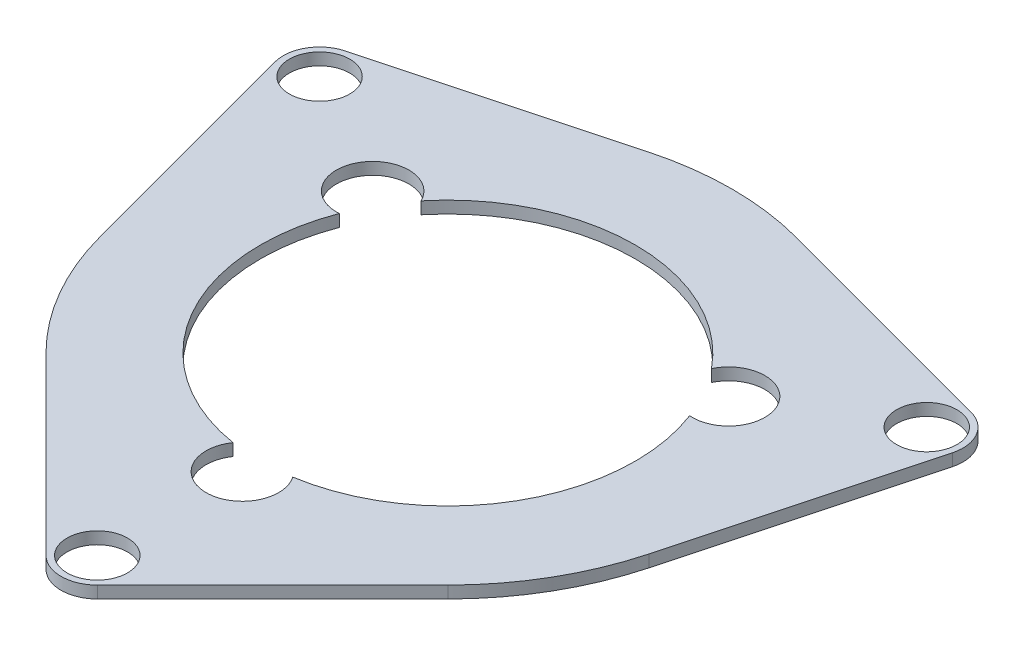
ISO-10303-21;
HEADER;
FILE_DESCRIPTION(('STEP AP214'),'2;1');
FILE_NAME('part.step','',(''),(''),'','','');
FILE_SCHEMA(('AUTOMOTIVE_DESIGN { 1 0 10303 214 1 1 1 1 }'));
ENDSEC;
DATA;
#1=APPLICATION_CONTEXT('core data for automotive mechanical design processes');
#2=APPLICATION_PROTOCOL_DEFINITION('international standard','automotive_design',2000,#1);
#3=PRODUCT_CONTEXT('',#1,'mechanical');
#4=PRODUCT('Part','Part','',(#3));
#5=PRODUCT_RELATED_PRODUCT_CATEGORY('part','',(#4));
#6=PRODUCT_DEFINITION_FORMATION('','',#4);
#7=PRODUCT_DEFINITION_CONTEXT('part definition',#1,'design');
#8=PRODUCT_DEFINITION('design','',#6,#7);
#9=PRODUCT_DEFINITION_SHAPE('','',#8);
#10=(LENGTH_UNIT() NAMED_UNIT(*) SI_UNIT(.MILLI.,.METRE.));
#11=(NAMED_UNIT(*) PLANE_ANGLE_UNIT() SI_UNIT($,.RADIAN.));
#12=(NAMED_UNIT(*) SI_UNIT($,.STERADIAN.) SOLID_ANGLE_UNIT());
#13=UNCERTAINTY_MEASURE_WITH_UNIT(LENGTH_MEASURE(1.E-05),#10,'distance_accuracy_value','');
#14=(GEOMETRIC_REPRESENTATION_CONTEXT(3) GLOBAL_UNCERTAINTY_ASSIGNED_CONTEXT((#13)) GLOBAL_UNIT_ASSIGNED_CONTEXT((#10,
#11,#12)) REPRESENTATION_CONTEXT('',''));
#15=CARTESIAN_POINT('',(0.,0.,0.));
#16=DIRECTION('',(0.,0.,1.));
#17=DIRECTION('',(1.,0.,0.));
#18=AXIS2_PLACEMENT_3D('',#15,#16,#17);
#19=CARTESIAN_POINT('',(0.,0.5,0.));
#20=DIRECTION('',(0.,-1.,0.));
#21=DIRECTION('',(0.,0.,-1.));
#22=AXIS2_PLACEMENT_3D('',#19,#20,#21);
#23=PLANE('',#22);
#24=CARTESIAN_POINT('',(0.,0.5,14.4999999999999));
#25=DIRECTION('',(0.,1.,0.));
#26=DIRECTION('',(0.,0.,1.));
#27=AXIS2_PLACEMENT_3D('',#24,#25,#26);
#28=CIRCLE('',#27,1.25);
#29=CARTESIAN_POINT('',(0.,0.5,15.7499999999999));
#30=VERTEX_POINT('',#29);
#31=EDGE_CURVE('E207',#30,#30,#28,.T.);
#32=ORIENTED_EDGE('',*,*,#31,.F.);
#33=EDGE_LOOP('',(#32));
#34=FACE_BOUND('',#33,.T.);
#35=CARTESIAN_POINT('',(-12.5573683548744,0.5,-7.24999999999988));
#36=DIRECTION('',(0.,1.,0.));
#37=DIRECTION('',(0.,0.,1.));
#38=AXIS2_PLACEMENT_3D('',#35,#36,#37);
#39=CIRCLE('',#38,1.25);
#40=CARTESIAN_POINT('',(-12.5573683548744,0.5,-5.99999999999988));
#41=VERTEX_POINT('',#40);
#42=EDGE_CURVE('E219',#41,#41,#39,.T.);
#43=ORIENTED_EDGE('',*,*,#42,.F.);
#44=EDGE_LOOP('',(#43));
#45=FACE_BOUND('',#44,.T.);
#46=CARTESIAN_POINT('',(0.,0.5,0.));
#47=DIRECTION('',(0.,1.,0.));
#48=DIRECTION('',(0.,0.,-1.));
#49=AXIS2_PLACEMENT_3D('',#46,#47,#48);
#50=CIRCLE('',#49,11.753048327205);
#51=CARTESIAN_POINT('',(3.0419127450911,0.5,-11.3525729168708));
#52=VERTEX_POINT('',#51);
#53=CARTESIAN_POINT('',(-3.0419127450911,0.5,-11.3525729168708));
#54=VERTEX_POINT('',#53);
#55=EDGE_CURVE('E225',#52,#54,#50,.T.);
#56=ORIENTED_EDGE('',*,*,#55,.T.);
#57=DIRECTION('',(-0.965925826289065,0.,0.258819045102533));
#58=VECTOR('',#57,1.);
#59=CARTESIAN_POINT('',(-3.0419127450911,0.5,-11.3525729168708));
#60=LINE('',#59,#58);
#61=CARTESIAN_POINT('',(-12.9455969225282,0.5,-8.69888873943348));
#62=VERTEX_POINT('',#61);
#63=EDGE_CURVE('E228',#54,#62,#60,.T.);
#64=ORIENTED_EDGE('',*,*,#63,.T.);
#65=CARTESIAN_POINT('',(-12.5573683548744,0.5,-7.24999999999988));
#66=DIRECTION('',(0.,1.,0.));
#67=DIRECTION('',(0.,0.,-1.));
#68=AXIS2_PLACEMENT_3D('',#65,#66,#67);
#69=CIRCLE('',#68,1.5);
#70=CARTESIAN_POINT('',(-14.006257094308,0.5,-6.86177143234609));
#71=VERTEX_POINT('',#70);
#72=EDGE_CURVE('E231',#62,#71,#69,.T.);
#73=ORIENTED_EDGE('',*,*,#72,.T.);
#74=DIRECTION('',(0.258819045102528,0.,0.965925826289066));
#75=VECTOR('',#74,1.);
#76=CARTESIAN_POINT('',(-11.3525729168708,0.5,3.04191274509105));
#77=LINE('',#76,#75);
#78=CARTESIAN_POINT('',(-11.3525729168708,0.5,3.04191274509105));
#79=VERTEX_POINT('',#78);
#80=EDGE_CURVE('E233',#71,#79,#77,.T.);
#81=ORIENTED_EDGE('',*,*,#80,.T.);
#82=CARTESIAN_POINT('',(0.,0.5,0.));
#83=DIRECTION('',(0.,1.,0.));
#84=DIRECTION('',(0.,0.,1.));
#85=AXIS2_PLACEMENT_3D('',#82,#83,#84);
#86=CIRCLE('',#85,11.753048327205);
#87=CARTESIAN_POINT('',(-8.31066017177983,0.5,8.31066017177985));
#88=VERTEX_POINT('',#87);
#89=EDGE_CURVE('E235',#79,#88,#86,.T.);
#90=ORIENTED_EDGE('',*,*,#89,.T.);
#91=DIRECTION('',(0.707106781186549,0.,0.707106781186546));
#92=VECTOR('',#91,1.);
#93=CARTESIAN_POINT('',(-8.31066017177982,0.5,8.31066017177985));
#94=LINE('',#93,#92);
#95=CARTESIAN_POINT('',(-1.06066017177982,0.5,15.5606601717798));
#96=VERTEX_POINT('',#95);
#97=EDGE_CURVE('E237',#88,#96,#94,.T.);
#98=ORIENTED_EDGE('',*,*,#97,.T.);
#99=CARTESIAN_POINT('',(0.,0.5,14.4999999999999));
#100=DIRECTION('',(0.,1.,0.));
#101=DIRECTION('',(0.,0.,1.));
#102=AXIS2_PLACEMENT_3D('',#99,#100,#101);
#103=CIRCLE('',#102,1.50000000000005);
#104=CARTESIAN_POINT('',(1.06066017177982,0.5,15.5606601717798));
#105=VERTEX_POINT('',#104);
#106=EDGE_CURVE('E239',#96,#105,#103,.T.);
#107=ORIENTED_EDGE('',*,*,#106,.T.);
#108=DIRECTION('',(0.707106781186548,0.,-0.707106781186547));
#109=VECTOR('',#108,1.);
#110=CARTESIAN_POINT('',(8.31066017177982,0.5,8.31066017177985));
#111=LINE('',#110,#109);
#112=CARTESIAN_POINT('',(8.31066017177982,0.5,8.31066017177985));
#113=VERTEX_POINT('',#112);
#114=EDGE_CURVE('E241',#105,#113,#111,.T.);
#115=ORIENTED_EDGE('',*,*,#114,.T.);
#116=CARTESIAN_POINT('',(0.,0.5,0.));
#117=DIRECTION('',(0.,1.,0.));
#118=DIRECTION('',(0.,0.,-1.));
#119=AXIS2_PLACEMENT_3D('',#116,#117,#118);
#120=CIRCLE('',#119,11.753048327205);
#121=CARTESIAN_POINT('',(11.3525729168708,0.5,3.04191274509105));
#122=VERTEX_POINT('',#121);
#123=EDGE_CURVE('E243',#113,#122,#120,.T.);
#124=ORIENTED_EDGE('',*,*,#123,.T.);
#125=DIRECTION('',(0.258819045102527,0.,-0.965925826289067));
#126=VECTOR('',#125,1.);
#127=CARTESIAN_POINT('',(11.3525729168708,0.5,3.04191274509105));
#128=LINE('',#127,#126);
#129=CARTESIAN_POINT('',(14.006257094308,0.5,-6.8617714323461));
#130=VERTEX_POINT('',#129);
#131=EDGE_CURVE('E245',#122,#130,#128,.T.);
#132=ORIENTED_EDGE('',*,*,#131,.T.);
#133=CARTESIAN_POINT('',(12.5573683548744,0.5,-7.24999999999991));
#134=DIRECTION('',(0.,1.,0.));
#135=DIRECTION('',(0.,0.,-1.));
#136=AXIS2_PLACEMENT_3D('',#133,#134,#135);
#137=CIRCLE('',#136,1.49999999999999);
#138=CARTESIAN_POINT('',(12.9455969225282,0.5,-8.69888873943349));
#139=VERTEX_POINT('',#138);
#140=EDGE_CURVE('E247',#130,#139,#137,.T.);
#141=ORIENTED_EDGE('',*,*,#140,.T.);
#142=DIRECTION('',(-0.965925826289065,0.,-0.258819045102532));
#143=VECTOR('',#142,1.);
#144=CARTESIAN_POINT('',(3.0419127450911,0.5,-11.3525729168708));
#145=LINE('',#144,#143);
#146=EDGE_CURVE('E249',#139,#52,#145,.T.);
#147=ORIENTED_EDGE('',*,*,#146,.T.);
#148=EDGE_LOOP('',(#56,#64,#73,#81,#90,#98,#107,#115,#124,#132,#141,#147));
#149=FACE_BOUND('',#148,.T.);
#150=CARTESIAN_POINT('',(12.5573683548744,0.5,-7.24999999999991));
#151=DIRECTION('',(0.,1.,0.));
#152=DIRECTION('',(0.,0.,1.));
#153=AXIS2_PLACEMENT_3D('',#150,#151,#152);
#154=CIRCLE('',#153,1.25);
#155=CARTESIAN_POINT('',(12.5573683548744,0.5,-5.99999999999991));
#156=VERTEX_POINT('',#155);
#157=EDGE_CURVE('E213',#156,#156,#154,.T.);
#158=ORIENTED_EDGE('',*,*,#157,.F.);
#159=EDGE_LOOP('',(#158));
#160=FACE_BOUND('',#159,.T.);
#161=CARTESIAN_POINT('',(0.,0.5,0.));
#162=DIRECTION('',(0.,1.,0.));
#163=DIRECTION('',(0.,0.,-1.));
#164=AXIS2_PLACEMENT_3D('',#161,#162,#163);
#165=CIRCLE('',#164,7.75);
#166=CARTESIAN_POINT('',(6.00751808071081,0.5,-4.89614404505553));
#167=VERTEX_POINT('',#166);
#168=CARTESIAN_POINT('',(-6.00751808071081,0.5,-4.89614404505553));
#169=VERTEX_POINT('',#168);
#170=EDGE_CURVE('E156',#167,#169,#165,.T.);
#171=ORIENTED_EDGE('',*,*,#170,.F.);
#172=CARTESIAN_POINT('',(7.36121593216777,0.5,-4.24999999999993));
#173=DIRECTION('',(0.,1.,0.));
#174=DIRECTION('',(0.,0.,-1.));
#175=AXIS2_PLACEMENT_3D('',#172,#173,#174);
#176=CIRCLE('',#175,1.5);
#177=CARTESIAN_POINT('',(7.24394416396144,0.5,-2.754591249062));
#178=VERTEX_POINT('',#177);
#179=EDGE_CURVE('E185',#178,#167,#176,.T.);
#180=ORIENTED_EDGE('',*,*,#179,.F.);
#181=CARTESIAN_POINT('',(0.,0.5,0.));
#182=DIRECTION('',(0.,1.,0.));
#183=DIRECTION('',(0.,0.,-1.));
#184=AXIS2_PLACEMENT_3D('',#181,#182,#183);
#185=CIRCLE('',#184,7.75);
#186=CARTESIAN_POINT('',(1.23642608325066,0.5,7.65073529411765));
#187=VERTEX_POINT('',#186);
#188=EDGE_CURVE('E183',#187,#178,#185,.T.);
#189=ORIENTED_EDGE('',*,*,#188,.F.);
#190=CARTESIAN_POINT('',(0.,0.5,8.5));
#191=DIRECTION('',(0.,1.,0.));
#192=DIRECTION('',(0.,0.,-1.));
#193=AXIS2_PLACEMENT_3D('',#190,#191,#192);
#194=CIRCLE('',#193,1.5);
#195=CARTESIAN_POINT('',(-1.23642608325065,0.5,7.65073529411765));
#196=VERTEX_POINT('',#195);
#197=EDGE_CURVE('E179',#196,#187,#194,.T.);
#198=ORIENTED_EDGE('',*,*,#197,.F.);
#199=CARTESIAN_POINT('',(0.,0.5,0.));
#200=DIRECTION('',(0.,1.,0.));
#201=DIRECTION('',(0.,0.,-1.));
#202=AXIS2_PLACEMENT_3D('',#199,#200,#201);
#203=CIRCLE('',#202,7.75);
#204=CARTESIAN_POINT('',(-7.24394416396144,0.5,-2.75459124906199));
#205=VERTEX_POINT('',#204);
#206=EDGE_CURVE('E177',#205,#196,#203,.T.);
#207=ORIENTED_EDGE('',*,*,#206,.F.);
#208=CARTESIAN_POINT('',(-7.36121593216777,0.5,-4.24999999999993));
#209=DIRECTION('',(0.,1.,0.));
#210=DIRECTION('',(0.,0.,-1.));
#211=AXIS2_PLACEMENT_3D('',#208,#209,#210);
#212=CIRCLE('',#211,1.5);
#213=EDGE_CURVE('E164',#169,#205,#212,.T.);
#214=ORIENTED_EDGE('',*,*,#213,.F.);
#215=EDGE_LOOP('',(#171,#180,#189,#198,#207,#214));
#216=FACE_BOUND('',#215,.T.);
#217=ADVANCED_FACE('F31',(#34,#45,#149,#160,#216),#23,.F.);
#218=CARTESIAN_POINT('',(0.,0.,0.));
#219=DIRECTION('',(0.,-1.,0.));
#220=DIRECTION('',(0.,0.,-1.));
#221=AXIS2_PLACEMENT_3D('',#218,#219,#220);
#222=PLANE('',#221);
#223=CARTESIAN_POINT('',(0.,0.,14.4999999999999));
#224=DIRECTION('',(0.,1.,0.));
#225=DIRECTION('',(0.,0.,1.));
#226=AXIS2_PLACEMENT_3D('',#223,#224,#225);
#227=CIRCLE('',#226,1.25);
#228=CARTESIAN_POINT('',(0.,0.,15.7499999999999));
#229=VERTEX_POINT('',#228);
#230=EDGE_CURVE('E172',#229,#229,#227,.T.);
#231=ORIENTED_EDGE('',*,*,#230,.T.);
#232=EDGE_LOOP('',(#231));
#233=FACE_BOUND('',#232,.T.);
#234=CARTESIAN_POINT('',(-12.5573683548744,0.,-7.24999999999988));
#235=DIRECTION('',(0.,1.,0.));
#236=DIRECTION('',(0.,0.,1.));
#237=AXIS2_PLACEMENT_3D('',#234,#235,#236);
#238=CIRCLE('',#237,1.25);
#239=CARTESIAN_POINT('',(-12.5573683548744,0.,-5.99999999999988));
#240=VERTEX_POINT('',#239);
#241=EDGE_CURVE('E216',#240,#240,#238,.T.);
#242=ORIENTED_EDGE('',*,*,#241,.T.);
#243=EDGE_LOOP('',(#242));
#244=FACE_BOUND('',#243,.T.);
#245=CARTESIAN_POINT('',(0.,0.,0.));
#246=DIRECTION('',(0.,1.,0.));
#247=DIRECTION('',(0.,0.,-1.));
#248=AXIS2_PLACEMENT_3D('',#245,#246,#247);
#249=CIRCLE('',#248,11.753048327205);
#250=CARTESIAN_POINT('',(3.0419127450911,0.,-11.3525729168708));
#251=VERTEX_POINT('',#250);
#252=CARTESIAN_POINT('',(-3.0419127450911,0.,-11.3525729168708));
#253=VERTEX_POINT('',#252);
#254=EDGE_CURVE('E222',#251,#253,#249,.T.);
#255=ORIENTED_EDGE('',*,*,#254,.F.);
#256=DIRECTION('',(-0.965925826289065,0.,-0.258819045102532));
#257=VECTOR('',#256,1.);
#258=CARTESIAN_POINT('',(3.0419127450911,0.,-11.3525729168708));
#259=LINE('',#258,#257);
#260=CARTESIAN_POINT('',(12.9455969225282,0.,-8.69888873943349));
#261=VERTEX_POINT('',#260);
#262=EDGE_CURVE('E229',#261,#251,#259,.T.);
#263=ORIENTED_EDGE('',*,*,#262,.F.);
#264=CARTESIAN_POINT('',(12.5573683548744,0.,-7.24999999999991));
#265=DIRECTION('',(0.,1.,0.));
#266=DIRECTION('',(0.,0.,-1.));
#267=AXIS2_PLACEMENT_3D('',#264,#265,#266);
#268=CIRCLE('',#267,1.49999999999999);
#269=CARTESIAN_POINT('',(14.006257094308,0.,-6.8617714323461));
#270=VERTEX_POINT('',#269);
#271=EDGE_CURVE('E272',#270,#261,#268,.T.);
#272=ORIENTED_EDGE('',*,*,#271,.F.);
#273=DIRECTION('',(0.258819045102527,0.,-0.965925826289067));
#274=VECTOR('',#273,1.);
#275=CARTESIAN_POINT('',(11.3525729168708,0.,3.04191274509105));
#276=LINE('',#275,#274);
#277=CARTESIAN_POINT('',(11.3525729168708,0.,3.04191274509105));
#278=VERTEX_POINT('',#277);
#279=EDGE_CURVE('E270',#278,#270,#276,.T.);
#280=ORIENTED_EDGE('',*,*,#279,.F.);
#281=CARTESIAN_POINT('',(0.,0.,0.));
#282=DIRECTION('',(0.,1.,0.));
#283=DIRECTION('',(0.,0.,-1.));
#284=AXIS2_PLACEMENT_3D('',#281,#282,#283);
#285=CIRCLE('',#284,11.753048327205);
#286=CARTESIAN_POINT('',(8.31066017177982,0.,8.31066017177985));
#287=VERTEX_POINT('',#286);
#288=EDGE_CURVE('E268',#287,#278,#285,.T.);
#289=ORIENTED_EDGE('',*,*,#288,.F.);
#290=DIRECTION('',(0.707106781186548,0.,-0.707106781186547));
#291=VECTOR('',#290,1.);
#292=CARTESIAN_POINT('',(8.31066017177982,0.,8.31066017177985));
#293=LINE('',#292,#291);
#294=CARTESIAN_POINT('',(1.06066017177982,0.,15.5606601717798));
#295=VERTEX_POINT('',#294);
#296=EDGE_CURVE('E266',#295,#287,#293,.T.);
#297=ORIENTED_EDGE('',*,*,#296,.F.);
#298=CARTESIAN_POINT('',(0.,0.,14.4999999999999));
#299=DIRECTION('',(0.,1.,0.));
#300=DIRECTION('',(0.,0.,1.));
#301=AXIS2_PLACEMENT_3D('',#298,#299,#300);
#302=CIRCLE('',#301,1.50000000000005);
#303=CARTESIAN_POINT('',(-1.06066017177982,0.,15.5606601717798));
#304=VERTEX_POINT('',#303);
#305=EDGE_CURVE('E264',#304,#295,#302,.T.);
#306=ORIENTED_EDGE('',*,*,#305,.F.);
#307=DIRECTION('',(0.707106781186549,0.,0.707106781186546));
#308=VECTOR('',#307,1.);
#309=CARTESIAN_POINT('',(-8.31066017177982,0.,8.31066017177985));
#310=LINE('',#309,#308);
#311=CARTESIAN_POINT('',(-8.31066017177983,0.,8.31066017177985));
#312=VERTEX_POINT('',#311);
#313=EDGE_CURVE('E262',#312,#304,#310,.T.);
#314=ORIENTED_EDGE('',*,*,#313,.F.);
#315=CARTESIAN_POINT('',(0.,0.,0.));
#316=DIRECTION('',(0.,1.,0.));
#317=DIRECTION('',(0.,0.,1.));
#318=AXIS2_PLACEMENT_3D('',#315,#316,#317);
#319=CIRCLE('',#318,11.753048327205);
#320=CARTESIAN_POINT('',(-11.3525729168708,0.,3.04191274509105));
#321=VERTEX_POINT('',#320);
#322=EDGE_CURVE('E260',#321,#312,#319,.T.);
#323=ORIENTED_EDGE('',*,*,#322,.F.);
#324=DIRECTION('',(0.258819045102528,0.,0.965925826289066));
#325=VECTOR('',#324,1.);
#326=CARTESIAN_POINT('',(-11.3525729168708,0.,3.04191274509105));
#327=LINE('',#326,#325);
#328=CARTESIAN_POINT('',(-14.006257094308,0.,-6.86177143234609));
#329=VERTEX_POINT('',#328);
#330=EDGE_CURVE('E258',#329,#321,#327,.T.);
#331=ORIENTED_EDGE('',*,*,#330,.F.);
#332=CARTESIAN_POINT('',(-12.5573683548744,0.,-7.24999999999988));
#333=DIRECTION('',(0.,1.,0.));
#334=DIRECTION('',(0.,0.,-1.));
#335=AXIS2_PLACEMENT_3D('',#332,#333,#334);
#336=CIRCLE('',#335,1.5);
#337=CARTESIAN_POINT('',(-12.9455969225282,0.,-8.69888873943348));
#338=VERTEX_POINT('',#337);
#339=EDGE_CURVE('E256',#338,#329,#336,.T.);
#340=ORIENTED_EDGE('',*,*,#339,.F.);
#341=DIRECTION('',(-0.965925826289065,0.,0.258819045102533));
#342=VECTOR('',#341,1.);
#343=CARTESIAN_POINT('',(-3.0419127450911,0.,-11.3525729168708));
#344=LINE('',#343,#342);
#345=EDGE_CURVE('E254',#253,#338,#344,.T.);
#346=ORIENTED_EDGE('',*,*,#345,.F.);
#347=EDGE_LOOP('',(#255,#263,#272,#280,#289,#297,#306,#314,#323,#331,#340,#346));
#348=FACE_BOUND('',#347,.T.);
#349=CARTESIAN_POINT('',(12.5573683548744,0.,-7.24999999999991));
#350=DIRECTION('',(0.,1.,0.));
#351=DIRECTION('',(0.,0.,1.));
#352=AXIS2_PLACEMENT_3D('',#349,#350,#351);
#353=CIRCLE('',#352,1.25);
#354=CARTESIAN_POINT('',(12.5573683548744,0.,-5.99999999999991));
#355=VERTEX_POINT('',#354);
#356=EDGE_CURVE('E210',#355,#355,#353,.T.);
#357=ORIENTED_EDGE('',*,*,#356,.T.);
#358=EDGE_LOOP('',(#357));
#359=FACE_BOUND('',#358,.T.);
#360=CARTESIAN_POINT('',(7.36121593216777,0.,-4.24999999999993));
#361=DIRECTION('',(0.,1.,0.));
#362=DIRECTION('',(0.,0.,-1.));
#363=AXIS2_PLACEMENT_3D('',#360,#361,#362);
#364=CIRCLE('',#363,1.5);
#365=CARTESIAN_POINT('',(7.24394416396144,0.,-2.754591249062));
#366=VERTEX_POINT('',#365);
#367=CARTESIAN_POINT('',(6.00751808071081,0.,-4.89614404505553));
#368=VERTEX_POINT('',#367);
#369=EDGE_CURVE('E165',#366,#368,#364,.T.);
#370=ORIENTED_EDGE('',*,*,#369,.T.);
#371=CARTESIAN_POINT('',(0.,0.,0.));
#372=DIRECTION('',(0.,1.,0.));
#373=DIRECTION('',(0.,0.,-1.));
#374=AXIS2_PLACEMENT_3D('',#371,#372,#373);
#375=CIRCLE('',#374,7.75);
#376=CARTESIAN_POINT('',(-6.00751808071081,0.,-4.89614404505553));
#377=VERTEX_POINT('',#376);
#378=EDGE_CURVE('E54',#368,#377,#375,.T.);
#379=ORIENTED_EDGE('',*,*,#378,.T.);
#380=CARTESIAN_POINT('',(-7.36121593216777,0.,-4.24999999999993));
#381=DIRECTION('',(0.,1.,0.));
#382=DIRECTION('',(0.,0.,-1.));
#383=AXIS2_PLACEMENT_3D('',#380,#381,#382);
#384=CIRCLE('',#383,1.5);
#385=CARTESIAN_POINT('',(-7.24394416396144,0.,-2.75459124906199));
#386=VERTEX_POINT('',#385);
#387=EDGE_CURVE('E171',#377,#386,#384,.T.);
#388=ORIENTED_EDGE('',*,*,#387,.T.);
#389=CARTESIAN_POINT('',(0.,0.,0.));
#390=DIRECTION('',(0.,1.,0.));
#391=DIRECTION('',(0.,0.,-1.));
#392=AXIS2_PLACEMENT_3D('',#389,#390,#391);
#393=CIRCLE('',#392,7.75);
#394=CARTESIAN_POINT('',(-1.23642608325065,0.,7.65073529411765));
#395=VERTEX_POINT('',#394);
#396=EDGE_CURVE('E189',#386,#395,#393,.T.);
#397=ORIENTED_EDGE('',*,*,#396,.T.);
#398=CARTESIAN_POINT('',(0.,0.,8.5));
#399=DIRECTION('',(0.,1.,0.));
#400=DIRECTION('',(0.,0.,-1.));
#401=AXIS2_PLACEMENT_3D('',#398,#399,#400);
#402=CIRCLE('',#401,1.5);
#403=CARTESIAN_POINT('',(1.23642608325066,0.,7.65073529411765));
#404=VERTEX_POINT('',#403);
#405=EDGE_CURVE('E192',#395,#404,#402,.T.);
#406=ORIENTED_EDGE('',*,*,#405,.T.);
#407=CARTESIAN_POINT('',(0.,0.,0.));
#408=DIRECTION('',(0.,1.,0.));
#409=DIRECTION('',(0.,0.,-1.));
#410=AXIS2_PLACEMENT_3D('',#407,#408,#409);
#411=CIRCLE('',#410,7.75);
#412=EDGE_CURVE('E195',#404,#366,#411,.T.);
#413=ORIENTED_EDGE('',*,*,#412,.T.);
#414=EDGE_LOOP('',(#370,#379,#388,#397,#406,#413));
#415=FACE_BOUND('',#414,.T.);
#416=ADVANCED_FACE('F314',(#233,#244,#348,#359,#415),#222,.T.);
#417=CARTESIAN_POINT('',(0.,0.5,0.));
#418=DIRECTION('',(0.,-1.,0.));
#419=DIRECTION('',(0.,0.,-1.));
#420=AXIS2_PLACEMENT_3D('',#417,#418,#419);
#421=CYLINDRICAL_SURFACE('',#420,11.753048327205);
#422=ORIENTED_EDGE('',*,*,#254,.T.);
#423=DIRECTION('',(0.,-1.,0.));
#424=VECTOR('',#423,1.);
#425=CARTESIAN_POINT('',(-3.0419127450911,0.5,-11.3525729168708));
#426=LINE('',#425,#424);
#427=EDGE_CURVE('E11',#54,#253,#426,.T.);
#428=ORIENTED_EDGE('',*,*,#427,.F.);
#429=ORIENTED_EDGE('',*,*,#55,.F.);
#430=DIRECTION('',(0.,-1.,0.));
#431=VECTOR('',#430,1.);
#432=CARTESIAN_POINT('',(3.0419127450911,0.5,-11.3525729168708));
#433=LINE('',#432,#431);
#434=EDGE_CURVE('E251',#52,#251,#433,.T.);
#435=ORIENTED_EDGE('',*,*,#434,.T.);
#436=EDGE_LOOP('',(#422,#428,#429,#435));
#437=FACE_BOUND('',#436,.T.);
#438=ADVANCED_FACE('F33',(#437),#421,.T.);
#439=CARTESIAN_POINT('',(-3.0419127450911,0.5,-11.3525729168708));
#440=DIRECTION('',(0.258819045102533,0.,0.965925826289065));
#441=DIRECTION('',(0.965925826289065,0.,-0.258819045102533));
#442=AXIS2_PLACEMENT_3D('',#439,#440,#441);
#443=PLANE('',#442);
#444=ORIENTED_EDGE('',*,*,#345,.T.);
#445=DIRECTION('',(0.,-1.,0.));
#446=VECTOR('',#445,1.);
#447=CARTESIAN_POINT('',(-12.9455969225282,0.5,-8.69888873943348));
#448=LINE('',#447,#446);
#449=EDGE_CURVE('E39',#62,#338,#448,.T.);
#450=ORIENTED_EDGE('',*,*,#449,.F.);
#451=ORIENTED_EDGE('',*,*,#63,.F.);
#452=ORIENTED_EDGE('',*,*,#427,.T.);
#453=EDGE_LOOP('',(#444,#450,#451,#452));
#454=FACE_BOUND('',#453,.T.);
#455=ADVANCED_FACE('F332',(#454),#443,.F.);
#456=CARTESIAN_POINT('',(-12.5573683548744,0.5,-7.24999999999988));
#457=DIRECTION('',(0.,-1.,0.));
#458=DIRECTION('',(0.,0.,-1.));
#459=AXIS2_PLACEMENT_3D('',#456,#457,#458);
#460=CYLINDRICAL_SURFACE('',#459,1.5);
#461=ORIENTED_EDGE('',*,*,#339,.T.);
#462=DIRECTION('',(0.,-1.,0.));
#463=VECTOR('',#462,1.);
#464=CARTESIAN_POINT('',(-14.006257094308,0.5,-6.86177143234609));
#465=LINE('',#464,#463);
#466=EDGE_CURVE('E301',#71,#329,#465,.T.);
#467=ORIENTED_EDGE('',*,*,#466,.F.);
#468=ORIENTED_EDGE('',*,*,#72,.F.);
#469=ORIENTED_EDGE('',*,*,#449,.T.);
#470=EDGE_LOOP('',(#461,#467,#468,#469));
#471=FACE_BOUND('',#470,.T.);
#472=ADVANCED_FACE('F308',(#471),#460,.T.);
#473=CARTESIAN_POINT('',(-11.3525729168708,0.5,3.04191274509105));
#474=DIRECTION('',(0.965925826289067,0.,-0.258819045102528));
#475=DIRECTION('',(-0.258819045102528,0.,-0.965925826289067));
#476=AXIS2_PLACEMENT_3D('',#473,#474,#475);
#477=PLANE('',#476);
#478=ORIENTED_EDGE('',*,*,#330,.T.);
#479=DIRECTION('',(0.,-1.,0.));
#480=VECTOR('',#479,1.);
#481=CARTESIAN_POINT('',(-11.3525729168708,0.5,3.04191274509105));
#482=LINE('',#481,#480);
#483=EDGE_CURVE('E298',#79,#321,#482,.T.);
#484=ORIENTED_EDGE('',*,*,#483,.F.);
#485=ORIENTED_EDGE('',*,*,#80,.F.);
#486=ORIENTED_EDGE('',*,*,#466,.T.);
#487=EDGE_LOOP('',(#478,#484,#485,#486));
#488=FACE_BOUND('',#487,.T.);
#489=ADVANCED_FACE('F320',(#488),#477,.F.);
#490=CARTESIAN_POINT('',(0.,0.5,0.));
#491=DIRECTION('',(0.,-1.,0.));
#492=DIRECTION('',(0.,0.,-1.));
#493=AXIS2_PLACEMENT_3D('',#490,#491,#492);
#494=CYLINDRICAL_SURFACE('',#493,11.753048327205);
#495=ORIENTED_EDGE('',*,*,#322,.T.);
#496=DIRECTION('',(0.,-1.,0.));
#497=VECTOR('',#496,1.);
#498=CARTESIAN_POINT('',(-8.31066017177983,0.5,8.31066017177985));
#499=LINE('',#498,#497);
#500=EDGE_CURVE('E295',#88,#312,#499,.T.);
#501=ORIENTED_EDGE('',*,*,#500,.F.);
#502=ORIENTED_EDGE('',*,*,#89,.F.);
#503=ORIENTED_EDGE('',*,*,#483,.T.);
#504=EDGE_LOOP('',(#495,#501,#502,#503));
#505=FACE_BOUND('',#504,.T.);
#506=ADVANCED_FACE('F324',(#505),#494,.T.);
#507=CARTESIAN_POINT('',(-8.31066017177982,0.5,8.31066017177985));
#508=DIRECTION('',(0.707106781186546,0.,-0.707106781186549));
#509=DIRECTION('',(-0.707106781186549,0.,-0.707106781186546));
#510=AXIS2_PLACEMENT_3D('',#507,#508,#509);
#511=PLANE('',#510);
#512=ORIENTED_EDGE('',*,*,#313,.T.);
#513=DIRECTION('',(0.,-1.,0.));
#514=VECTOR('',#513,1.);
#515=CARTESIAN_POINT('',(-1.06066017177982,0.5,15.5606601717798));
#516=LINE('',#515,#514);
#517=EDGE_CURVE('E292',#96,#304,#516,.T.);
#518=ORIENTED_EDGE('',*,*,#517,.F.);
#519=ORIENTED_EDGE('',*,*,#97,.F.);
#520=ORIENTED_EDGE('',*,*,#500,.T.);
#521=EDGE_LOOP('',(#512,#518,#519,#520));
#522=FACE_BOUND('',#521,.T.);
#523=ADVANCED_FACE('F365',(#522),#511,.F.);
#524=CARTESIAN_POINT('',(0.,0.5,14.4999999999999));
#525=DIRECTION('',(0.,-1.,0.));
#526=DIRECTION('',(0.,0.,-1.));
#527=AXIS2_PLACEMENT_3D('',#524,#525,#526);
#528=CYLINDRICAL_SURFACE('',#527,1.50000000000005);
#529=ORIENTED_EDGE('',*,*,#305,.T.);
#530=DIRECTION('',(0.,-1.,0.));
#531=VECTOR('',#530,1.);
#532=CARTESIAN_POINT('',(1.06066017177982,0.5,15.5606601717798));
#533=LINE('',#532,#531);
#534=EDGE_CURVE('E289',#105,#295,#533,.T.);
#535=ORIENTED_EDGE('',*,*,#534,.F.);
#536=ORIENTED_EDGE('',*,*,#106,.F.);
#537=ORIENTED_EDGE('',*,*,#517,.T.);
#538=EDGE_LOOP('',(#529,#535,#536,#537));
#539=FACE_BOUND('',#538,.T.);
#540=ADVANCED_FACE('F363',(#539),#528,.T.);
#541=CARTESIAN_POINT('',(8.31066017177982,0.5,8.31066017177985));
#542=DIRECTION('',(-0.707106781186547,0.,-0.707106781186548));
#543=DIRECTION('',(-0.707106781186548,0.,0.707106781186547));
#544=AXIS2_PLACEMENT_3D('',#541,#542,#543);
#545=PLANE('',#544);
#546=ORIENTED_EDGE('',*,*,#296,.T.);
#547=DIRECTION('',(0.,-1.,0.));
#548=VECTOR('',#547,1.);
#549=CARTESIAN_POINT('',(8.31066017177982,0.5,8.31066017177985));
#550=LINE('',#549,#548);
#551=EDGE_CURVE('E286',#113,#287,#550,.T.);
#552=ORIENTED_EDGE('',*,*,#551,.F.);
#553=ORIENTED_EDGE('',*,*,#114,.F.);
#554=ORIENTED_EDGE('',*,*,#534,.T.);
#555=EDGE_LOOP('',(#546,#552,#553,#554));
#556=FACE_BOUND('',#555,.T.);
#557=ADVANCED_FACE('F359',(#556),#545,.F.);
#558=CARTESIAN_POINT('',(0.,0.5,0.));
#559=DIRECTION('',(0.,-1.,0.));
#560=DIRECTION('',(0.,0.,-1.));
#561=AXIS2_PLACEMENT_3D('',#558,#559,#560);
#562=CYLINDRICAL_SURFACE('',#561,11.753048327205);
#563=ORIENTED_EDGE('',*,*,#288,.T.);
#564=DIRECTION('',(0.,-1.,0.));
#565=VECTOR('',#564,1.);
#566=CARTESIAN_POINT('',(11.3525729168708,0.5,3.04191274509105));
#567=LINE('',#566,#565);
#568=EDGE_CURVE('E283',#122,#278,#567,.T.);
#569=ORIENTED_EDGE('',*,*,#568,.F.);
#570=ORIENTED_EDGE('',*,*,#123,.F.);
#571=ORIENTED_EDGE('',*,*,#551,.T.);
#572=EDGE_LOOP('',(#563,#569,#570,#571));
#573=FACE_BOUND('',#572,.T.);
#574=ADVANCED_FACE('F354',(#573),#562,.T.);
#575=CARTESIAN_POINT('',(11.3525729168708,0.5,3.04191274509105));
#576=DIRECTION('',(-0.965925826289066,0.,-0.258819045102527));
#577=DIRECTION('',(-0.258819045102527,0.,0.965925826289067));
#578=AXIS2_PLACEMENT_3D('',#575,#576,#577);
#579=PLANE('',#578);
#580=ORIENTED_EDGE('',*,*,#279,.T.);
#581=DIRECTION('',(0.,-1.,0.));
#582=VECTOR('',#581,1.);
#583=CARTESIAN_POINT('',(14.006257094308,0.5,-6.8617714323461));
#584=LINE('',#583,#582);
#585=EDGE_CURVE('E280',#130,#270,#584,.T.);
#586=ORIENTED_EDGE('',*,*,#585,.F.);
#587=ORIENTED_EDGE('',*,*,#131,.F.);
#588=ORIENTED_EDGE('',*,*,#568,.T.);
#589=EDGE_LOOP('',(#580,#586,#587,#588));
#590=FACE_BOUND('',#589,.T.);
#591=ADVANCED_FACE('F348',(#590),#579,.F.);
#592=CARTESIAN_POINT('',(12.5573683548744,0.5,-7.24999999999991));
#593=DIRECTION('',(0.,-1.,0.));
#594=DIRECTION('',(0.,0.,-1.));
#595=AXIS2_PLACEMENT_3D('',#592,#593,#594);
#596=CYLINDRICAL_SURFACE('',#595,1.49999999999999);
#597=ORIENTED_EDGE('',*,*,#271,.T.);
#598=DIRECTION('',(0.,-1.,0.));
#599=VECTOR('',#598,1.);
#600=CARTESIAN_POINT('',(12.9455969225282,0.5,-8.69888873943349));
#601=LINE('',#600,#599);
#602=EDGE_CURVE('E277',#139,#261,#601,.T.);
#603=ORIENTED_EDGE('',*,*,#602,.F.);
#604=ORIENTED_EDGE('',*,*,#140,.F.);
#605=ORIENTED_EDGE('',*,*,#585,.T.);
#606=EDGE_LOOP('',(#597,#603,#604,#605));
#607=FACE_BOUND('',#606,.T.);
#608=ADVANCED_FACE('F344',(#607),#596,.T.);
#609=CARTESIAN_POINT('',(3.0419127450911,0.5,-11.3525729168708));
#610=DIRECTION('',(-0.258819045102532,0.,0.965925826289065));
#611=DIRECTION('',(0.965925826289065,0.,0.258819045102532));
#612=AXIS2_PLACEMENT_3D('',#609,#610,#611);
#613=PLANE('',#612);
#614=ORIENTED_EDGE('',*,*,#262,.T.);
#615=ORIENTED_EDGE('',*,*,#434,.F.);
#616=ORIENTED_EDGE('',*,*,#146,.F.);
#617=ORIENTED_EDGE('',*,*,#602,.T.);
#618=EDGE_LOOP('',(#614,#615,#616,#617));
#619=FACE_BOUND('',#618,.T.);
#620=ADVANCED_FACE('F339',(#619),#613,.F.);
#621=CARTESIAN_POINT('',(-12.5573683548744,0.5,-7.24999999999988));
#622=DIRECTION('',(0.,-1.,0.));
#623=DIRECTION('',(0.,0.,-1.));
#624=AXIS2_PLACEMENT_3D('',#621,#622,#623);
#625=CYLINDRICAL_SURFACE('',#624,1.25);
#626=ORIENTED_EDGE('',*,*,#42,.T.);
#627=EDGE_LOOP('',(#626));
#628=FACE_BOUND('',#627,.T.);
#629=ORIENTED_EDGE('',*,*,#241,.F.);
#630=EDGE_LOOP('',(#629));
#631=FACE_BOUND('',#630,.T.);
#632=ADVANCED_FACE('F385',(#628,#631),#625,.F.);
#633=CARTESIAN_POINT('',(12.5573683548744,0.5,-7.24999999999991));
#634=DIRECTION('',(0.,-1.,0.));
#635=DIRECTION('',(0.,0.,-1.));
#636=AXIS2_PLACEMENT_3D('',#633,#634,#635);
#637=CYLINDRICAL_SURFACE('',#636,1.25);
#638=ORIENTED_EDGE('',*,*,#157,.T.);
#639=EDGE_LOOP('',(#638));
#640=FACE_BOUND('',#639,.T.);
#641=ORIENTED_EDGE('',*,*,#356,.F.);
#642=EDGE_LOOP('',(#641));
#643=FACE_BOUND('',#642,.T.);
#644=ADVANCED_FACE('F423',(#640,#643),#637,.F.);
#645=CARTESIAN_POINT('',(0.,0.5,14.4999999999999));
#646=DIRECTION('',(0.,-1.,0.));
#647=DIRECTION('',(0.,0.,-1.));
#648=AXIS2_PLACEMENT_3D('',#645,#646,#647);
#649=CYLINDRICAL_SURFACE('',#648,1.25);
#650=ORIENTED_EDGE('',*,*,#31,.T.);
#651=EDGE_LOOP('',(#650));
#652=FACE_BOUND('',#651,.T.);
#653=ORIENTED_EDGE('',*,*,#230,.F.);
#654=EDGE_LOOP('',(#653));
#655=FACE_BOUND('',#654,.T.);
#656=ADVANCED_FACE('F430',(#652,#655),#649,.F.);
#657=CARTESIAN_POINT('',(0.,0.5,0.));
#658=DIRECTION('',(0.,-1.,0.));
#659=DIRECTION('',(0.,0.,-1.));
#660=AXIS2_PLACEMENT_3D('',#657,#658,#659);
#661=CYLINDRICAL_SURFACE('',#660,7.75);
#662=ORIENTED_EDGE('',*,*,#378,.F.);
#663=DIRECTION('',(0.,-1.,0.));
#664=VECTOR('',#663,1.);
#665=CARTESIAN_POINT('',(6.00751808071081,0.5,-4.89614404505553));
#666=LINE('',#665,#664);
#667=EDGE_CURVE('E160',#167,#368,#666,.T.);
#668=ORIENTED_EDGE('',*,*,#667,.F.);
#669=ORIENTED_EDGE('',*,*,#170,.T.);
#670=DIRECTION('',(0.,-1.,0.));
#671=VECTOR('',#670,1.);
#672=CARTESIAN_POINT('',(-6.00751808071081,0.5,-4.89614404505553));
#673=LINE('',#672,#671);
#674=EDGE_CURVE('E159',#169,#377,#673,.T.);
#675=ORIENTED_EDGE('',*,*,#674,.T.);
#676=EDGE_LOOP('',(#662,#668,#669,#675));
#677=FACE_BOUND('',#676,.T.);
#678=ADVANCED_FACE('F158',(#677),#661,.F.);
#679=CARTESIAN_POINT('',(-7.36121593216777,0.5,-4.24999999999993));
#680=DIRECTION('',(0.,-1.,0.));
#681=DIRECTION('',(0.,0.,-1.));
#682=AXIS2_PLACEMENT_3D('',#679,#680,#681);
#683=CYLINDRICAL_SURFACE('',#682,1.5);
#684=ORIENTED_EDGE('',*,*,#387,.F.);
#685=ORIENTED_EDGE('',*,*,#674,.F.);
#686=ORIENTED_EDGE('',*,*,#213,.T.);
#687=DIRECTION('',(0.,-1.,0.));
#688=VECTOR('',#687,1.);
#689=CARTESIAN_POINT('',(-7.24394416396144,0.5,-2.75459124906199));
#690=LINE('',#689,#688);
#691=EDGE_CURVE('E173',#205,#386,#690,.T.);
#692=ORIENTED_EDGE('',*,*,#691,.T.);
#693=EDGE_LOOP('',(#684,#685,#686,#692));
#694=FACE_BOUND('',#693,.T.);
#695=ADVANCED_FACE('F168',(#694),#683,.F.);
#696=CARTESIAN_POINT('',(0.,0.5,0.));
#697=DIRECTION('',(0.,-1.,0.));
#698=DIRECTION('',(0.,0.,-1.));
#699=AXIS2_PLACEMENT_3D('',#696,#697,#698);
#700=CYLINDRICAL_SURFACE('',#699,7.75);
#701=ORIENTED_EDGE('',*,*,#396,.F.);
#702=ORIENTED_EDGE('',*,*,#691,.F.);
#703=ORIENTED_EDGE('',*,*,#206,.T.);
#704=DIRECTION('',(0.,-1.,0.));
#705=VECTOR('',#704,1.);
#706=CARTESIAN_POINT('',(-1.23642608325065,0.5,7.65073529411765));
#707=LINE('',#706,#705);
#708=EDGE_CURVE('E204',#196,#395,#707,.T.);
#709=ORIENTED_EDGE('',*,*,#708,.T.);
#710=EDGE_LOOP('',(#701,#702,#703,#709));
#711=FACE_BOUND('',#710,.T.);
#712=ADVANCED_FACE('F450',(#711),#700,.F.);
#713=CARTESIAN_POINT('',(0.,0.5,8.5));
#714=DIRECTION('',(0.,-1.,0.));
#715=DIRECTION('',(0.,0.,-1.));
#716=AXIS2_PLACEMENT_3D('',#713,#714,#715);
#717=CYLINDRICAL_SURFACE('',#716,1.5);
#718=ORIENTED_EDGE('',*,*,#405,.F.);
#719=ORIENTED_EDGE('',*,*,#708,.F.);
#720=ORIENTED_EDGE('',*,*,#197,.T.);
#721=DIRECTION('',(0.,-1.,0.));
#722=VECTOR('',#721,1.);
#723=CARTESIAN_POINT('',(1.23642608325066,0.5,7.65073529411765));
#724=LINE('',#723,#722);
#725=EDGE_CURVE('E202',#187,#404,#724,.T.);
#726=ORIENTED_EDGE('',*,*,#725,.T.);
#727=EDGE_LOOP('',(#718,#719,#720,#726));
#728=FACE_BOUND('',#727,.T.);
#729=ADVANCED_FACE('F457',(#728),#717,.F.);
#730=CARTESIAN_POINT('',(0.,0.5,0.));
#731=DIRECTION('',(0.,-1.,0.));
#732=DIRECTION('',(0.,0.,-1.));
#733=AXIS2_PLACEMENT_3D('',#730,#731,#732);
#734=CYLINDRICAL_SURFACE('',#733,7.75);
#735=ORIENTED_EDGE('',*,*,#412,.F.);
#736=ORIENTED_EDGE('',*,*,#725,.F.);
#737=ORIENTED_EDGE('',*,*,#188,.T.);
#738=DIRECTION('',(0.,-1.,0.));
#739=VECTOR('',#738,1.);
#740=CARTESIAN_POINT('',(7.24394416396144,0.5,-2.754591249062));
#741=LINE('',#740,#739);
#742=EDGE_CURVE('E46',#178,#366,#741,.T.);
#743=ORIENTED_EDGE('',*,*,#742,.T.);
#744=EDGE_LOOP('',(#735,#736,#737,#743));
#745=FACE_BOUND('',#744,.T.);
#746=ADVANCED_FACE('F465',(#745),#734,.F.);
#747=CARTESIAN_POINT('',(7.36121593216777,0.5,-4.24999999999993));
#748=DIRECTION('',(0.,-1.,0.));
#749=DIRECTION('',(0.,0.,-1.));
#750=AXIS2_PLACEMENT_3D('',#747,#748,#749);
#751=CYLINDRICAL_SURFACE('',#750,1.5);
#752=ORIENTED_EDGE('',*,*,#369,.F.);
#753=ORIENTED_EDGE('',*,*,#742,.F.);
#754=ORIENTED_EDGE('',*,*,#179,.T.);
#755=ORIENTED_EDGE('',*,*,#667,.T.);
#756=EDGE_LOOP('',(#752,#753,#754,#755));
#757=FACE_BOUND('',#756,.T.);
#758=ADVANCED_FACE('F473',(#757),#751,.F.);
#759=CLOSED_SHELL('',(#217,#416,#438,#455,#472,#489,#506,#523,#540,#557,#574,#591,#608,#620,
#632,#644,#656,#678,#695,#712,#729,#746,#758));
#760=MANIFOLD_SOLID_BREP('B2',#759);
#761=ADVANCED_BREP_SHAPE_REPRESENTATION('',(#18,#760),#14);
#762=SHAPE_DEFINITION_REPRESENTATION(#9,#761);
ENDSEC;
END-ISO-10303-21;
